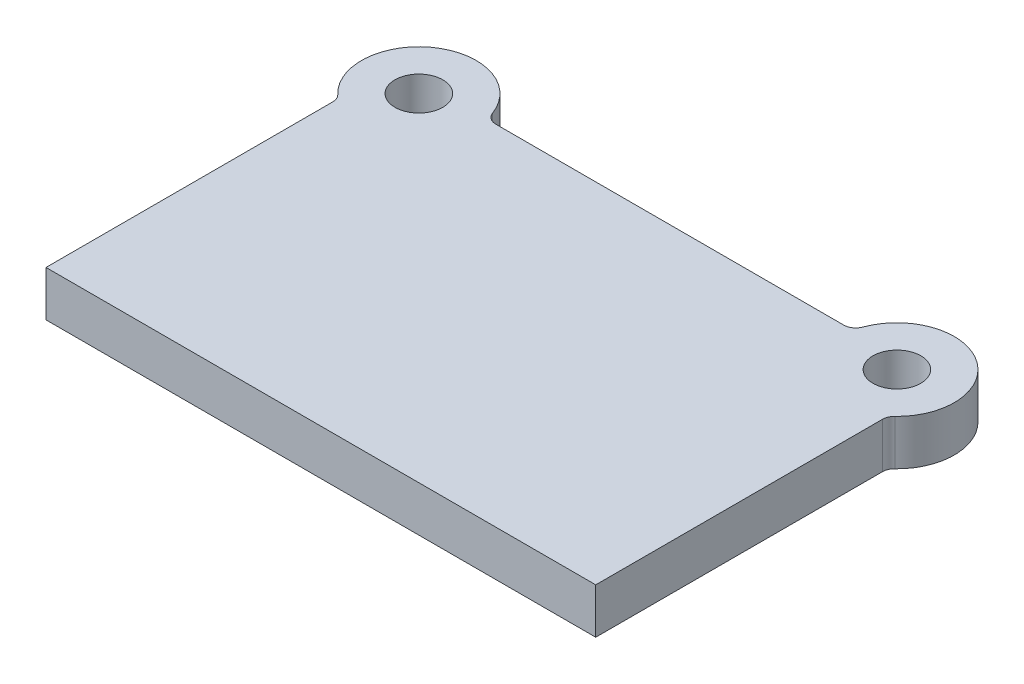
ISO-10303-21;
HEADER;
FILE_DESCRIPTION(('STEP AP214'),'2;1');
FILE_NAME('part.step','',(''),(''),'','','');
FILE_SCHEMA(('AUTOMOTIVE_DESIGN { 1 0 10303 214 1 1 1 1 }'));
ENDSEC;
DATA;
#1=APPLICATION_CONTEXT('core data for automotive mechanical design processes');
#2=APPLICATION_PROTOCOL_DEFINITION('international standard','automotive_design',2000,#1);
#3=PRODUCT_CONTEXT('',#1,'mechanical');
#4=PRODUCT('Part','Part','',(#3));
#5=PRODUCT_RELATED_PRODUCT_CATEGORY('part','',(#4));
#6=PRODUCT_DEFINITION_FORMATION('','',#4);
#7=PRODUCT_DEFINITION_CONTEXT('part definition',#1,'design');
#8=PRODUCT_DEFINITION('design','',#6,#7);
#9=PRODUCT_DEFINITION_SHAPE('','',#8);
#10=(LENGTH_UNIT() NAMED_UNIT(*) SI_UNIT(.MILLI.,.METRE.));
#11=(NAMED_UNIT(*) PLANE_ANGLE_UNIT() SI_UNIT($,.RADIAN.));
#12=(NAMED_UNIT(*) SI_UNIT($,.STERADIAN.) SOLID_ANGLE_UNIT());
#13=UNCERTAINTY_MEASURE_WITH_UNIT(LENGTH_MEASURE(1.E-05),#10,'distance_accuracy_value','');
#14=(GEOMETRIC_REPRESENTATION_CONTEXT(3) GLOBAL_UNCERTAINTY_ASSIGNED_CONTEXT((#13)) GLOBAL_UNIT_ASSIGNED_CONTEXT((#10,
#11,#12)) REPRESENTATION_CONTEXT('',''));
#15=CARTESIAN_POINT('',(0.,0.,0.));
#16=DIRECTION('',(0.,0.,1.));
#17=DIRECTION('',(1.,0.,0.));
#18=AXIS2_PLACEMENT_3D('',#15,#16,#17);
#19=CARTESIAN_POINT('',(-200.,38.,-282.));
#20=DIRECTION('',(0.,1.,0.));
#21=DIRECTION('',(0.,0.,1.));
#22=AXIS2_PLACEMENT_3D('',#19,#20,#21);
#23=PLANE('',#22);
#24=CARTESIAN_POINT('',(-200.,38.,-282.));
#25=DIRECTION('',(0.,1.,0.));
#26=DIRECTION('',(0.,0.,1.));
#27=AXIS2_PLACEMENT_3D('',#24,#25,#26);
#28=CIRCLE('',#27,20.);
#29=CARTESIAN_POINT('',(-200.,38.,-262.));
#30=VERTEX_POINT('',#29);
#31=EDGE_CURVE('E200',#30,#30,#28,.T.);
#32=ORIENTED_EDGE('',*,*,#31,.F.);
#33=EDGE_LOOP('',(#32));
#34=FACE_BOUND('',#33,.T.);
#35=CARTESIAN_POINT('',(-200.,38.,-282.));
#36=DIRECTION('',(0.,1.,0.));
#37=DIRECTION('',(0.,0.,1.));
#38=AXIS2_PLACEMENT_3D('',#35,#36,#37);
#39=CIRCLE('',#38,48.);
#40=CARTESIAN_POINT('',(-154.944030050815,38.,-298.551724137931));
#41=VERTEX_POINT('',#40);
#42=CARTESIAN_POINT('',(-233.103448275862,38.,-247.241379310345));
#43=VERTEX_POINT('',#42);
#44=EDGE_CURVE('E139',#41,#43,#39,.T.);
#45=ORIENTED_EDGE('',*,*,#44,.T.);
#46=CARTESIAN_POINT('',(-240.,38.,-240.));
#47=DIRECTION('',(0.,1.,0.));
#48=DIRECTION('',(0.,0.,1.));
#49=AXIS2_PLACEMENT_3D('',#46,#47,#48);
#50=CIRCLE('',#49,10.);
#51=CARTESIAN_POINT('',(-230.,38.,-240.));
#52=VERTEX_POINT('',#51);
#53=EDGE_CURVE('E116',#43,#52,#50,.F.);
#54=ORIENTED_EDGE('',*,*,#53,.T.);
#55=DIRECTION('',(0.,0.,1.));
#56=VECTOR('',#55,1.);
#57=CARTESIAN_POINT('',(-230.,38.,0.));
#58=LINE('',#57,#56);
#59=CARTESIAN_POINT('',(-230.,38.,0.));
#60=VERTEX_POINT('',#59);
#61=EDGE_CURVE('E109',#52,#60,#58,.T.);
#62=ORIENTED_EDGE('',*,*,#61,.T.);
#63=DIRECTION('',(1.,0.,0.));
#64=VECTOR('',#63,1.);
#65=CARTESIAN_POINT('',(230.,38.,0.));
#66=LINE('',#65,#64);
#67=CARTESIAN_POINT('',(230.,38.,0.));
#68=VERTEX_POINT('',#67);
#69=EDGE_CURVE('E113',#60,#68,#66,.T.);
#70=ORIENTED_EDGE('',*,*,#69,.T.);
#71=DIRECTION('',(0.,0.,-1.));
#72=VECTOR('',#71,1.);
#73=CARTESIAN_POINT('',(230.,38.,0.));
#74=LINE('',#73,#72);
#75=CARTESIAN_POINT('',(230.,38.,-240.));
#76=VERTEX_POINT('',#75);
#77=EDGE_CURVE('E129',#68,#76,#74,.T.);
#78=ORIENTED_EDGE('',*,*,#77,.T.);
#79=CARTESIAN_POINT('',(240.,38.,-240.));
#80=DIRECTION('',(0.,1.,0.));
#81=DIRECTION('',(0.,0.,1.));
#82=AXIS2_PLACEMENT_3D('',#79,#80,#81);
#83=CIRCLE('',#82,10.);
#84=CARTESIAN_POINT('',(233.103448275862,38.,-247.241379310345));
#85=VERTEX_POINT('',#84);
#86=EDGE_CURVE('E11',#76,#85,#83,.F.);
#87=ORIENTED_EDGE('',*,*,#86,.T.);
#88=CARTESIAN_POINT('',(200.,38.,-282.));
#89=DIRECTION('',(0.,1.,0.));
#90=DIRECTION('',(0.,0.,-1.));
#91=AXIS2_PLACEMENT_3D('',#88,#89,#90);
#92=CIRCLE('',#91,48.);
#93=CARTESIAN_POINT('',(154.944030050815,38.,-298.551724137931));
#94=VERTEX_POINT('',#93);
#95=EDGE_CURVE('E203',#85,#94,#92,.T.);
#96=ORIENTED_EDGE('',*,*,#95,.T.);
#97=CARTESIAN_POINT('',(145.557369644735,38.,-302.));
#98=DIRECTION('',(0.,1.,0.));
#99=DIRECTION('',(0.,0.,1.));
#100=AXIS2_PLACEMENT_3D('',#97,#98,#99);
#101=CIRCLE('',#100,10.);
#102=CARTESIAN_POINT('',(145.557369644735,38.,-292.));
#103=VERTEX_POINT('',#102);
#104=EDGE_CURVE('E160',#94,#103,#101,.F.);
#105=ORIENTED_EDGE('',*,*,#104,.T.);
#106=DIRECTION('',(-1.,0.,0.));
#107=VECTOR('',#106,1.);
#108=CARTESIAN_POINT('',(153.053221622778,38.,-292.));
#109=LINE('',#108,#107);
#110=CARTESIAN_POINT('',(-145.557369644735,38.,-292.));
#111=VERTEX_POINT('',#110);
#112=EDGE_CURVE('E172',#103,#111,#109,.T.);
#113=ORIENTED_EDGE('',*,*,#112,.T.);
#114=CARTESIAN_POINT('',(-145.557369644735,38.,-302.));
#115=DIRECTION('',(0.,1.,0.));
#116=DIRECTION('',(0.,0.,1.));
#117=AXIS2_PLACEMENT_3D('',#114,#115,#116);
#118=CIRCLE('',#117,10.);
#119=EDGE_CURVE('E167',#111,#41,#118,.F.);
#120=ORIENTED_EDGE('',*,*,#119,.T.);
#121=EDGE_LOOP('',(#45,#54,#62,#70,#78,#87,#96,#105,#113,#120));
#122=FACE_BOUND('',#121,.T.);
#123=CARTESIAN_POINT('',(200.,38.,-282.));
#124=DIRECTION('',(0.,1.,0.));
#125=DIRECTION('',(0.,0.,-1.));
#126=AXIS2_PLACEMENT_3D('',#123,#124,#125);
#127=CIRCLE('',#126,20.);
#128=CARTESIAN_POINT('',(200.,38.,-302.));
#129=VERTEX_POINT('',#128);
#130=EDGE_CURVE('E210',#129,#129,#127,.T.);
#131=ORIENTED_EDGE('',*,*,#130,.F.);
#132=EDGE_LOOP('',(#131));
#133=FACE_BOUND('',#132,.T.);
#134=ADVANCED_FACE('F33',(#34,#122,#133),#23,.T.);
#135=CARTESIAN_POINT('',(-200.,0.,-282.));
#136=DIRECTION('',(0.,1.,0.));
#137=DIRECTION('',(0.,0.,1.));
#138=AXIS2_PLACEMENT_3D('',#135,#136,#137);
#139=PLANE('',#138);
#140=DIRECTION('',(0.,0.,1.));
#141=VECTOR('',#140,1.);
#142=CARTESIAN_POINT('',(-230.,0.,0.));
#143=LINE('',#142,#141);
#144=CARTESIAN_POINT('',(-230.,0.,-240.));
#145=VERTEX_POINT('',#144);
#146=CARTESIAN_POINT('',(-230.,0.,0.));
#147=VERTEX_POINT('',#146);
#148=EDGE_CURVE('E133',#145,#147,#143,.T.);
#149=ORIENTED_EDGE('',*,*,#148,.F.);
#150=CARTESIAN_POINT('',(-240.,0.,-240.));
#151=DIRECTION('',(0.,1.,0.));
#152=DIRECTION('',(0.,0.,1.));
#153=AXIS2_PLACEMENT_3D('',#150,#151,#152);
#154=CIRCLE('',#153,10.);
#155=CARTESIAN_POINT('',(-233.103448275862,0.,-247.241379310345));
#156=VERTEX_POINT('',#155);
#157=EDGE_CURVE('E162',#145,#156,#154,.T.);
#158=ORIENTED_EDGE('',*,*,#157,.T.);
#159=CARTESIAN_POINT('',(-200.,0.,-282.));
#160=DIRECTION('',(0.,1.,0.));
#161=DIRECTION('',(0.,0.,1.));
#162=AXIS2_PLACEMENT_3D('',#159,#160,#161);
#163=CIRCLE('',#162,48.);
#164=CARTESIAN_POINT('',(-154.944030050815,0.,-298.551724137931));
#165=VERTEX_POINT('',#164);
#166=EDGE_CURVE('E121',#165,#156,#163,.T.);
#167=ORIENTED_EDGE('',*,*,#166,.F.);
#168=CARTESIAN_POINT('',(-145.557369644735,0.,-302.));
#169=DIRECTION('',(0.,1.,0.));
#170=DIRECTION('',(0.,0.,1.));
#171=AXIS2_PLACEMENT_3D('',#168,#169,#170);
#172=CIRCLE('',#171,10.);
#173=CARTESIAN_POINT('',(-145.557369644735,0.,-292.));
#174=VERTEX_POINT('',#173);
#175=EDGE_CURVE('E165',#165,#174,#172,.T.);
#176=ORIENTED_EDGE('',*,*,#175,.T.);
#177=DIRECTION('',(-1.,0.,0.));
#178=VECTOR('',#177,1.);
#179=CARTESIAN_POINT('',(153.053221622778,0.,-292.));
#180=LINE('',#179,#178);
#181=CARTESIAN_POINT('',(145.557369644735,0.,-292.));
#182=VERTEX_POINT('',#181);
#183=EDGE_CURVE('E187',#182,#174,#180,.T.);
#184=ORIENTED_EDGE('',*,*,#183,.F.);
#185=CARTESIAN_POINT('',(145.557369644735,0.,-302.));
#186=DIRECTION('',(0.,1.,0.));
#187=DIRECTION('',(0.,0.,1.));
#188=AXIS2_PLACEMENT_3D('',#185,#186,#187);
#189=CIRCLE('',#188,10.);
#190=CARTESIAN_POINT('',(154.944030050815,0.,-298.551724137931));
#191=VERTEX_POINT('',#190);
#192=EDGE_CURVE('E158',#182,#191,#189,.T.);
#193=ORIENTED_EDGE('',*,*,#192,.T.);
#194=CARTESIAN_POINT('',(200.,0.,-282.));
#195=DIRECTION('',(0.,1.,0.));
#196=DIRECTION('',(0.,0.,-1.));
#197=AXIS2_PLACEMENT_3D('',#194,#195,#196);
#198=CIRCLE('',#197,48.);
#199=CARTESIAN_POINT('',(233.103448275862,0.,-247.241379310345));
#200=VERTEX_POINT('',#199);
#201=EDGE_CURVE('E191',#200,#191,#198,.T.);
#202=ORIENTED_EDGE('',*,*,#201,.F.);
#203=CARTESIAN_POINT('',(240.,0.,-240.));
#204=DIRECTION('',(0.,1.,0.));
#205=DIRECTION('',(0.,0.,1.));
#206=AXIS2_PLACEMENT_3D('',#203,#204,#205);
#207=CIRCLE('',#206,10.);
#208=CARTESIAN_POINT('',(230.,0.,-240.));
#209=VERTEX_POINT('',#208);
#210=EDGE_CURVE('E41',#200,#209,#207,.T.);
#211=ORIENTED_EDGE('',*,*,#210,.T.);
#212=DIRECTION('',(0.,0.,-1.));
#213=VECTOR('',#212,1.);
#214=CARTESIAN_POINT('',(230.,0.,0.));
#215=LINE('',#214,#213);
#216=CARTESIAN_POINT('',(230.,0.,0.));
#217=VERTEX_POINT('',#216);
#218=EDGE_CURVE('E194',#217,#209,#215,.T.);
#219=ORIENTED_EDGE('',*,*,#218,.F.);
#220=DIRECTION('',(1.,0.,0.));
#221=VECTOR('',#220,1.);
#222=CARTESIAN_POINT('',(230.,0.,0.));
#223=LINE('',#222,#221);
#224=EDGE_CURVE('E198',#147,#217,#223,.T.);
#225=ORIENTED_EDGE('',*,*,#224,.F.);
#226=EDGE_LOOP('',(#149,#158,#167,#176,#184,#193,#202,#211,#219,#225));
#227=FACE_BOUND('',#226,.T.);
#228=CARTESIAN_POINT('',(-200.,0.,-282.));
#229=DIRECTION('',(0.,1.,0.));
#230=DIRECTION('',(0.,0.,1.));
#231=AXIS2_PLACEMENT_3D('',#228,#229,#230);
#232=CIRCLE('',#231,20.);
#233=CARTESIAN_POINT('',(-200.,0.,-262.));
#234=VERTEX_POINT('',#233);
#235=EDGE_CURVE('E207',#234,#234,#232,.T.);
#236=ORIENTED_EDGE('',*,*,#235,.T.);
#237=EDGE_LOOP('',(#236));
#238=FACE_BOUND('',#237,.T.);
#239=CARTESIAN_POINT('',(200.,0.,-282.));
#240=DIRECTION('',(0.,1.,0.));
#241=DIRECTION('',(0.,0.,-1.));
#242=AXIS2_PLACEMENT_3D('',#239,#240,#241);
#243=CIRCLE('',#242,20.);
#244=CARTESIAN_POINT('',(200.,0.,-302.));
#245=VERTEX_POINT('',#244);
#246=EDGE_CURVE('E213',#245,#245,#243,.T.);
#247=ORIENTED_EDGE('',*,*,#246,.T.);
#248=EDGE_LOOP('',(#247));
#249=FACE_BOUND('',#248,.T.);
#250=ADVANCED_FACE('F185',(#227,#238,#249),#139,.F.);
#251=CARTESIAN_POINT('',(-230.,38.,0.));
#252=DIRECTION('',(1.,0.,0.));
#253=DIRECTION('',(0.,0.,-1.));
#254=AXIS2_PLACEMENT_3D('',#251,#252,#253);
#255=PLANE('',#254);
#256=ORIENTED_EDGE('',*,*,#61,.F.);
#257=DIRECTION('',(0.,1.,0.));
#258=VECTOR('',#257,1.);
#259=CARTESIAN_POINT('',(-230.,0.,-240.));
#260=LINE('',#259,#258);
#261=EDGE_CURVE('E150',#52,#145,#260,.F.);
#262=ORIENTED_EDGE('',*,*,#261,.T.);
#263=ORIENTED_EDGE('',*,*,#148,.T.);
#264=DIRECTION('',(0.,-1.,0.));
#265=VECTOR('',#264,1.);
#266=CARTESIAN_POINT('',(-230.,38.,0.));
#267=LINE('',#266,#265);
#268=EDGE_CURVE('E126',#60,#147,#267,.T.);
#269=ORIENTED_EDGE('',*,*,#268,.F.);
#270=EDGE_LOOP('',(#256,#262,#263,#269));
#271=FACE_BOUND('',#270,.T.);
#272=ADVANCED_FACE('F131',(#271),#255,.F.);
#273=CARTESIAN_POINT('',(230.,38.,0.));
#274=DIRECTION('',(0.,0.,-1.));
#275=DIRECTION('',(-1.,0.,0.));
#276=AXIS2_PLACEMENT_3D('',#273,#274,#275);
#277=PLANE('',#276);
#278=ORIENTED_EDGE('',*,*,#224,.T.);
#279=DIRECTION('',(0.,-1.,0.));
#280=VECTOR('',#279,1.);
#281=CARTESIAN_POINT('',(230.,38.,0.));
#282=LINE('',#281,#280);
#283=EDGE_CURVE('E128',#68,#217,#282,.T.);
#284=ORIENTED_EDGE('',*,*,#283,.F.);
#285=ORIENTED_EDGE('',*,*,#69,.F.);
#286=ORIENTED_EDGE('',*,*,#268,.T.);
#287=EDGE_LOOP('',(#278,#284,#285,#286));
#288=FACE_BOUND('',#287,.T.);
#289=ADVANCED_FACE('F125',(#288),#277,.F.);
#290=CARTESIAN_POINT('',(230.,38.,0.));
#291=DIRECTION('',(-1.,0.,0.));
#292=DIRECTION('',(0.,0.,1.));
#293=AXIS2_PLACEMENT_3D('',#290,#291,#292);
#294=PLANE('',#293);
#295=ORIENTED_EDGE('',*,*,#218,.T.);
#296=DIRECTION('',(0.,1.,0.));
#297=VECTOR('',#296,1.);
#298=CARTESIAN_POINT('',(230.,38.,-240.));
#299=LINE('',#298,#297);
#300=EDGE_CURVE('E48',#209,#76,#299,.T.);
#301=ORIENTED_EDGE('',*,*,#300,.T.);
#302=ORIENTED_EDGE('',*,*,#77,.F.);
#303=ORIENTED_EDGE('',*,*,#283,.T.);
#304=EDGE_LOOP('',(#295,#301,#302,#303));
#305=FACE_BOUND('',#304,.T.);
#306=ADVANCED_FACE('F240',(#305),#294,.F.);
#307=CARTESIAN_POINT('',(200.,38.,-282.));
#308=DIRECTION('',(0.,-1.,0.));
#309=DIRECTION('',(0.,0.,-1.));
#310=AXIS2_PLACEMENT_3D('',#307,#308,#309);
#311=CYLINDRICAL_SURFACE('',#310,48.);
#312=ORIENTED_EDGE('',*,*,#201,.T.);
#313=DIRECTION('',(0.,-1.,0.));
#314=VECTOR('',#313,1.);
#315=CARTESIAN_POINT('',(154.944030050815,38.,-298.551724137931));
#316=LINE('',#315,#314);
#317=EDGE_CURVE('E148',#191,#94,#316,.F.);
#318=ORIENTED_EDGE('',*,*,#317,.T.);
#319=ORIENTED_EDGE('',*,*,#95,.F.);
#320=DIRECTION('',(0.,-1.,0.));
#321=VECTOR('',#320,1.);
#322=CARTESIAN_POINT('',(233.103448275862,38.,-247.241379310345));
#323=LINE('',#322,#321);
#324=EDGE_CURVE('E145',#85,#200,#323,.T.);
#325=ORIENTED_EDGE('',*,*,#324,.T.);
#326=EDGE_LOOP('',(#312,#318,#319,#325));
#327=FACE_BOUND('',#326,.T.);
#328=ADVANCED_FACE('F237',(#327),#311,.T.);
#329=CARTESIAN_POINT('',(153.053221622778,38.,-292.));
#330=DIRECTION('',(0.,0.,1.));
#331=DIRECTION('',(1.,0.,0.));
#332=AXIS2_PLACEMENT_3D('',#329,#330,#331);
#333=PLANE('',#332);
#334=ORIENTED_EDGE('',*,*,#112,.F.);
#335=DIRECTION('',(0.,1.,0.));
#336=VECTOR('',#335,1.);
#337=CARTESIAN_POINT('',(145.557369644735,0.,-292.));
#338=LINE('',#337,#336);
#339=EDGE_CURVE('E137',#103,#182,#338,.F.);
#340=ORIENTED_EDGE('',*,*,#339,.T.);
#341=ORIENTED_EDGE('',*,*,#183,.T.);
#342=DIRECTION('',(0.,1.,0.));
#343=VECTOR('',#342,1.);
#344=CARTESIAN_POINT('',(-145.557369644735,38.,-292.));
#345=LINE('',#344,#343);
#346=EDGE_CURVE('E135',#174,#111,#345,.T.);
#347=ORIENTED_EDGE('',*,*,#346,.T.);
#348=EDGE_LOOP('',(#334,#340,#341,#347));
#349=FACE_BOUND('',#348,.T.);
#350=ADVANCED_FACE('F189',(#349),#333,.F.);
#351=CARTESIAN_POINT('',(-200.,38.,-282.));
#352=DIRECTION('',(0.,-1.,0.));
#353=DIRECTION('',(0.,0.,-1.));
#354=AXIS2_PLACEMENT_3D('',#351,#352,#353);
#355=CYLINDRICAL_SURFACE('',#354,48.);
#356=ORIENTED_EDGE('',*,*,#166,.T.);
#357=DIRECTION('',(0.,-1.,0.));
#358=VECTOR('',#357,1.);
#359=CARTESIAN_POINT('',(-233.103448275862,38.,-247.241379310345));
#360=LINE('',#359,#358);
#361=EDGE_CURVE('E155',#156,#43,#360,.F.);
#362=ORIENTED_EDGE('',*,*,#361,.T.);
#363=ORIENTED_EDGE('',*,*,#44,.F.);
#364=DIRECTION('',(0.,-1.,0.));
#365=VECTOR('',#364,1.);
#366=CARTESIAN_POINT('',(-154.944030050815,38.,-298.551724137931));
#367=LINE('',#366,#365);
#368=EDGE_CURVE('E152',#41,#165,#367,.T.);
#369=ORIENTED_EDGE('',*,*,#368,.T.);
#370=EDGE_LOOP('',(#356,#362,#363,#369));
#371=FACE_BOUND('',#370,.T.);
#372=ADVANCED_FACE('F178',(#371),#355,.T.);
#373=CARTESIAN_POINT('',(-200.,38.,-282.));
#374=DIRECTION('',(0.,-1.,0.));
#375=DIRECTION('',(0.,0.,-1.));
#376=AXIS2_PLACEMENT_3D('',#373,#374,#375);
#377=CYLINDRICAL_SURFACE('',#376,20.);
#378=ORIENTED_EDGE('',*,*,#31,.T.);
#379=EDGE_LOOP('',(#378));
#380=FACE_BOUND('',#379,.T.);
#381=ORIENTED_EDGE('',*,*,#235,.F.);
#382=EDGE_LOOP('',(#381));
#383=FACE_BOUND('',#382,.T.);
#384=ADVANCED_FACE('F230',(#380,#383),#377,.F.);
#385=CARTESIAN_POINT('',(200.,38.,-282.));
#386=DIRECTION('',(0.,-1.,0.));
#387=DIRECTION('',(0.,0.,-1.));
#388=AXIS2_PLACEMENT_3D('',#385,#386,#387);
#389=CYLINDRICAL_SURFACE('',#388,20.);
#390=ORIENTED_EDGE('',*,*,#130,.T.);
#391=EDGE_LOOP('',(#390));
#392=FACE_BOUND('',#391,.T.);
#393=ORIENTED_EDGE('',*,*,#246,.F.);
#394=EDGE_LOOP('',(#393));
#395=FACE_BOUND('',#394,.T.);
#396=ADVANCED_FACE('F219',(#392,#395),#389,.F.);
#397=CARTESIAN_POINT('',(145.557369644735,38.,-302.));
#398=DIRECTION('',(0.,-1.,0.));
#399=DIRECTION('',(0.,0.,-1.));
#400=AXIS2_PLACEMENT_3D('',#397,#398,#399);
#401=CYLINDRICAL_SURFACE('',#400,10.);
#402=ORIENTED_EDGE('',*,*,#104,.F.);
#403=ORIENTED_EDGE('',*,*,#317,.F.);
#404=ORIENTED_EDGE('',*,*,#192,.F.);
#405=ORIENTED_EDGE('',*,*,#339,.F.);
#406=EDGE_LOOP('',(#402,#403,#404,#405));
#407=FACE_BOUND('',#406,.T.);
#408=ADVANCED_FACE('F248',(#407),#401,.F.);
#409=CARTESIAN_POINT('',(-240.,38.,-240.));
#410=DIRECTION('',(0.,-1.,0.));
#411=DIRECTION('',(0.,0.,-1.));
#412=AXIS2_PLACEMENT_3D('',#409,#410,#411);
#413=CYLINDRICAL_SURFACE('',#412,10.);
#414=ORIENTED_EDGE('',*,*,#53,.F.);
#415=ORIENTED_EDGE('',*,*,#361,.F.);
#416=ORIENTED_EDGE('',*,*,#157,.F.);
#417=ORIENTED_EDGE('',*,*,#261,.F.);
#418=EDGE_LOOP('',(#414,#415,#416,#417));
#419=FACE_BOUND('',#418,.T.);
#420=ADVANCED_FACE('F251',(#419),#413,.F.);
#421=CARTESIAN_POINT('',(-145.557369644735,38.,-302.));
#422=DIRECTION('',(0.,-1.,0.));
#423=DIRECTION('',(0.,0.,-1.));
#424=AXIS2_PLACEMENT_3D('',#421,#422,#423);
#425=CYLINDRICAL_SURFACE('',#424,10.);
#426=ORIENTED_EDGE('',*,*,#119,.F.);
#427=ORIENTED_EDGE('',*,*,#346,.F.);
#428=ORIENTED_EDGE('',*,*,#175,.F.);
#429=ORIENTED_EDGE('',*,*,#368,.F.);
#430=EDGE_LOOP('',(#426,#427,#428,#429));
#431=FACE_BOUND('',#430,.T.);
#432=ADVANCED_FACE('F182',(#431),#425,.F.);
#433=CARTESIAN_POINT('',(240.,38.,-240.));
#434=DIRECTION('',(0.,-1.,0.));
#435=DIRECTION('',(0.,0.,-1.));
#436=AXIS2_PLACEMENT_3D('',#433,#434,#435);
#437=CYLINDRICAL_SURFACE('',#436,10.);
#438=ORIENTED_EDGE('',*,*,#86,.F.);
#439=ORIENTED_EDGE('',*,*,#300,.F.);
#440=ORIENTED_EDGE('',*,*,#210,.F.);
#441=ORIENTED_EDGE('',*,*,#324,.F.);
#442=EDGE_LOOP('',(#438,#439,#440,#441));
#443=FACE_BOUND('',#442,.T.);
#444=ADVANCED_FACE('F35',(#443),#437,.F.);
#445=CLOSED_SHELL('',(#134,#250,#272,#289,#306,#328,#350,#372,#384,#396,#408,#420,#432,#444));
#446=MANIFOLD_SOLID_BREP('B2',#445);
#447=ADVANCED_BREP_SHAPE_REPRESENTATION('',(#18,#446),#14);
#448=SHAPE_DEFINITION_REPRESENTATION(#9,#447);
ENDSEC;
END-ISO-10303-21;
